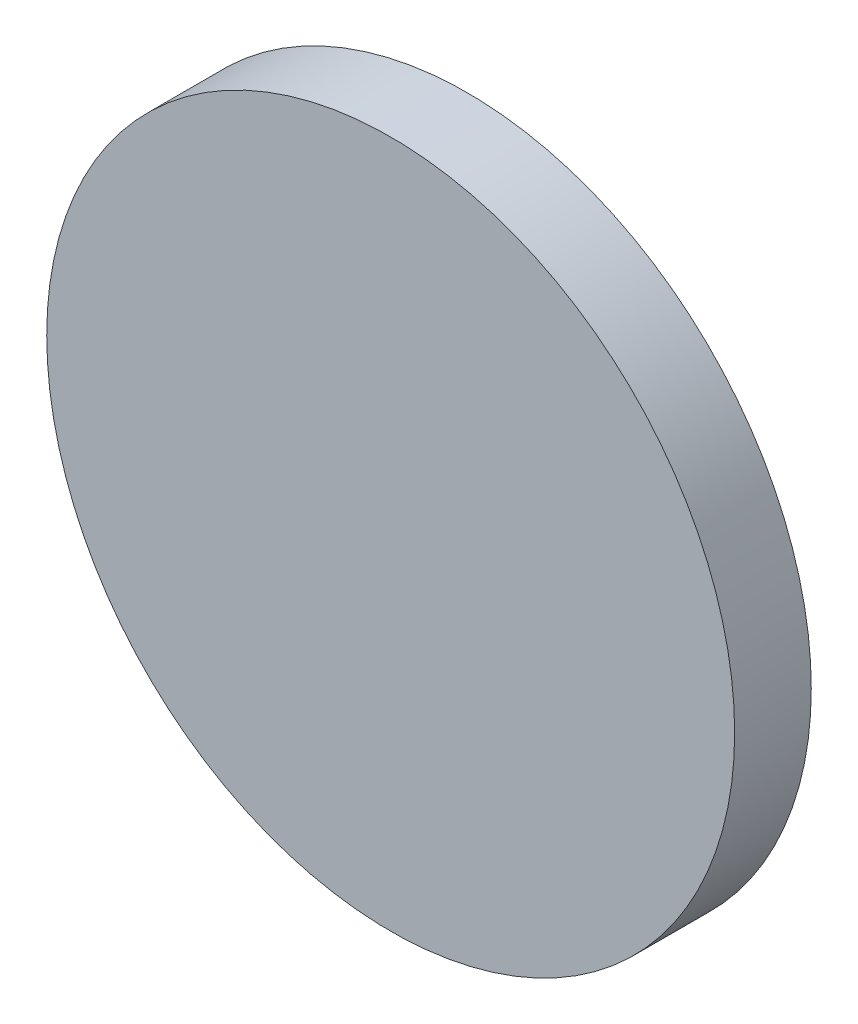
ISO-10303-21;
HEADER;
FILE_DESCRIPTION(('STEP AP214'),'2;1');
FILE_NAME('part.step','',(''),(''),'','','');
FILE_SCHEMA(('AUTOMOTIVE_DESIGN { 1 0 10303 214 1 1 1 1 }'));
ENDSEC;
DATA;
#1=APPLICATION_CONTEXT('core data for automotive mechanical design processes');
#2=APPLICATION_PROTOCOL_DEFINITION('international standard','automotive_design',2000,#1);
#3=PRODUCT_CONTEXT('',#1,'mechanical');
#4=PRODUCT('Part','Part','',(#3));
#5=PRODUCT_RELATED_PRODUCT_CATEGORY('part','',(#4));
#6=PRODUCT_DEFINITION_FORMATION('','',#4);
#7=PRODUCT_DEFINITION_CONTEXT('part definition',#1,'design');
#8=PRODUCT_DEFINITION('design','',#6,#7);
#9=PRODUCT_DEFINITION_SHAPE('','',#8);
#10=(LENGTH_UNIT() NAMED_UNIT(*) SI_UNIT(.MILLI.,.METRE.));
#11=(NAMED_UNIT(*) PLANE_ANGLE_UNIT() SI_UNIT($,.RADIAN.));
#12=(NAMED_UNIT(*) SI_UNIT($,.STERADIAN.) SOLID_ANGLE_UNIT());
#13=UNCERTAINTY_MEASURE_WITH_UNIT(LENGTH_MEASURE(1.E-05),#10,'distance_accuracy_value','');
#14=(GEOMETRIC_REPRESENTATION_CONTEXT(3) GLOBAL_UNCERTAINTY_ASSIGNED_CONTEXT((#13)) GLOBAL_UNIT_ASSIGNED_CONTEXT((#10,
#11,#12)) REPRESENTATION_CONTEXT('',''));
#15=CARTESIAN_POINT('',(0.,0.,0.));
#16=DIRECTION('',(0.,0.,1.));
#17=DIRECTION('',(1.,0.,0.));
#18=AXIS2_PLACEMENT_3D('',#15,#16,#17);
#19=CARTESIAN_POINT('',(0.,0.,10.));
#20=DIRECTION('',(0.,0.,-1.));
#21=DIRECTION('',(-1.,0.,0.));
#22=AXIS2_PLACEMENT_3D('',#19,#20,#21);
#23=CYLINDRICAL_SURFACE('',#22,44.9);
#24=CARTESIAN_POINT('',(0.,0.,10.));
#25=DIRECTION('',(0.,0.,1.));
#26=DIRECTION('',(1.,0.,0.));
#27=AXIS2_PLACEMENT_3D('',#24,#25,#26);
#28=CIRCLE('',#27,44.9);
#29=CARTESIAN_POINT('',(44.9,0.,10.));
#30=VERTEX_POINT('',#29);
#31=EDGE_CURVE('E10',#30,#30,#28,.T.);
#32=ORIENTED_EDGE('',*,*,#31,.F.);
#33=EDGE_LOOP('',(#32));
#34=FACE_BOUND('',#33,.T.);
#35=CARTESIAN_POINT('',(0.,0.,0.));
#36=DIRECTION('',(0.,0.,1.));
#37=DIRECTION('',(1.,0.,0.));
#38=AXIS2_PLACEMENT_3D('',#35,#36,#37);
#39=CIRCLE('',#38,44.9);
#40=CARTESIAN_POINT('',(44.9,0.,0.));
#41=VERTEX_POINT('',#40);
#42=EDGE_CURVE('E34',#41,#41,#39,.T.);
#43=ORIENTED_EDGE('',*,*,#42,.T.);
#44=EDGE_LOOP('',(#43));
#45=FACE_BOUND('',#44,.T.);
#46=ADVANCED_FACE('F31',(#34,#45),#23,.T.);
#47=CARTESIAN_POINT('',(0.,0.,10.));
#48=DIRECTION('',(0.,0.,1.));
#49=DIRECTION('',(1.,0.,0.));
#50=AXIS2_PLACEMENT_3D('',#47,#48,#49);
#51=PLANE('',#50);
#52=ORIENTED_EDGE('',*,*,#31,.T.);
#53=EDGE_LOOP('',(#52));
#54=FACE_BOUND('',#53,.T.);
#55=ADVANCED_FACE('F46',(#54),#51,.T.);
#56=CARTESIAN_POINT('',(0.,0.,0.));
#57=DIRECTION('',(0.,0.,1.));
#58=DIRECTION('',(1.,0.,0.));
#59=AXIS2_PLACEMENT_3D('',#56,#57,#58);
#60=PLANE('',#59);
#61=ORIENTED_EDGE('',*,*,#42,.F.);
#62=EDGE_LOOP('',(#61));
#63=FACE_BOUND('',#62,.T.);
#64=ADVANCED_FACE('F44',(#63),#60,.F.);
#65=CLOSED_SHELL('',(#46,#55,#64));
#66=MANIFOLD_SOLID_BREP('B2',#65);
#67=ADVANCED_BREP_SHAPE_REPRESENTATION('',(#18,#66),#14);
#68=SHAPE_DEFINITION_REPRESENTATION(#9,#67);
ENDSEC;
END-ISO-10303-21;
